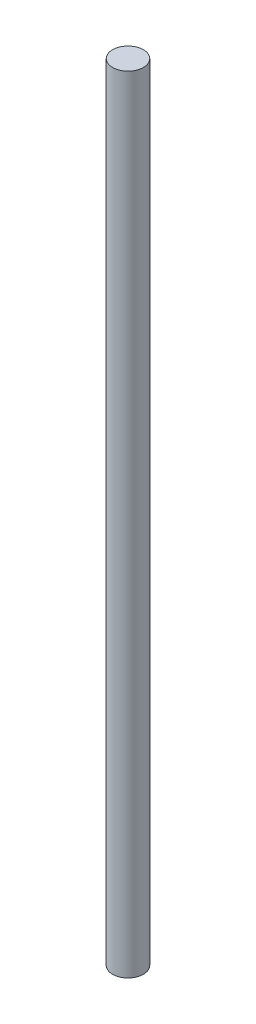
ISO-10303-21;
HEADER;
FILE_DESCRIPTION(('STEP AP214'),'2;1');
FILE_NAME('part.step','',(''),(''),'','','');
FILE_SCHEMA(('AUTOMOTIVE_DESIGN { 1 0 10303 214 1 1 1 1 }'));
ENDSEC;
DATA;
#1=APPLICATION_CONTEXT('core data for automotive mechanical design processes');
#2=APPLICATION_PROTOCOL_DEFINITION('international standard','automotive_design',2000,#1);
#3=PRODUCT_CONTEXT('',#1,'mechanical');
#4=PRODUCT('Part','Part','',(#3));
#5=PRODUCT_RELATED_PRODUCT_CATEGORY('part','',(#4));
#6=PRODUCT_DEFINITION_FORMATION('','',#4);
#7=PRODUCT_DEFINITION_CONTEXT('part definition',#1,'design');
#8=PRODUCT_DEFINITION('design','',#6,#7);
#9=PRODUCT_DEFINITION_SHAPE('','',#8);
#10=(LENGTH_UNIT() NAMED_UNIT(*) SI_UNIT(.MILLI.,.METRE.));
#11=(NAMED_UNIT(*) PLANE_ANGLE_UNIT() SI_UNIT($,.RADIAN.));
#12=(NAMED_UNIT(*) SI_UNIT($,.STERADIAN.) SOLID_ANGLE_UNIT());
#13=UNCERTAINTY_MEASURE_WITH_UNIT(LENGTH_MEASURE(1.E-05),#10,'distance_accuracy_value','');
#14=(GEOMETRIC_REPRESENTATION_CONTEXT(3) GLOBAL_UNCERTAINTY_ASSIGNED_CONTEXT((#13)) GLOBAL_UNIT_ASSIGNED_CONTEXT((#10,
#11,#12)) REPRESENTATION_CONTEXT('',''));
#15=CARTESIAN_POINT('',(0.,0.,0.));
#16=DIRECTION('',(0.,0.,1.));
#17=DIRECTION('',(1.,0.,0.));
#18=AXIS2_PLACEMENT_3D('',#15,#16,#17);
#19=CARTESIAN_POINT('',(0.,153.,0.));
#20=DIRECTION('',(0.,-1.,0.));
#21=DIRECTION('',(0.,0.,-1.));
#22=AXIS2_PLACEMENT_3D('',#19,#20,#21);
#23=CYLINDRICAL_SURFACE('',#22,3.);
#24=CARTESIAN_POINT('',(0.,153.,0.));
#25=DIRECTION('',(0.,1.,0.));
#26=DIRECTION('',(0.,0.,1.));
#27=AXIS2_PLACEMENT_3D('',#24,#25,#26);
#28=CIRCLE('',#27,3.);
#29=CARTESIAN_POINT('',(0.,153.,3.));
#30=VERTEX_POINT('',#29);
#31=EDGE_CURVE('E10',#30,#30,#28,.T.);
#32=ORIENTED_EDGE('',*,*,#31,.F.);
#33=EDGE_LOOP('',(#32));
#34=FACE_BOUND('',#33,.T.);
#35=CARTESIAN_POINT('',(0.,0.,0.));
#36=DIRECTION('',(0.,1.,0.));
#37=DIRECTION('',(0.,0.,1.));
#38=AXIS2_PLACEMENT_3D('',#35,#36,#37);
#39=CIRCLE('',#38,3.);
#40=CARTESIAN_POINT('',(0.,0.,3.));
#41=VERTEX_POINT('',#40);
#42=EDGE_CURVE('E40',#41,#41,#39,.T.);
#43=ORIENTED_EDGE('',*,*,#42,.T.);
#44=EDGE_LOOP('',(#43));
#45=FACE_BOUND('',#44,.T.);
#46=ADVANCED_FACE('F37',(#34,#45),#23,.T.);
#47=CARTESIAN_POINT('',(0.,153.,0.));
#48=DIRECTION('',(0.,1.,0.));
#49=DIRECTION('',(0.,0.,1.));
#50=AXIS2_PLACEMENT_3D('',#47,#48,#49);
#51=PLANE('',#50);
#52=ORIENTED_EDGE('',*,*,#31,.T.);
#53=EDGE_LOOP('',(#52));
#54=FACE_BOUND('',#53,.T.);
#55=ADVANCED_FACE('F54',(#54),#51,.T.);
#56=CARTESIAN_POINT('',(0.,0.,0.));
#57=DIRECTION('',(0.,1.,0.));
#58=DIRECTION('',(0.,0.,1.));
#59=AXIS2_PLACEMENT_3D('',#56,#57,#58);
#60=PLANE('',#59);
#61=ORIENTED_EDGE('',*,*,#42,.F.);
#62=EDGE_LOOP('',(#61));
#63=FACE_BOUND('',#62,.T.);
#64=ADVANCED_FACE('F52',(#63),#60,.F.);
#65=CLOSED_SHELL('',(#46,#55,#64));
#66=MANIFOLD_SOLID_BREP('B2',#65);
#67=ADVANCED_BREP_SHAPE_REPRESENTATION('',(#18,#66),#14);
#68=SHAPE_DEFINITION_REPRESENTATION(#9,#67);
ENDSEC;
END-ISO-10303-21;
